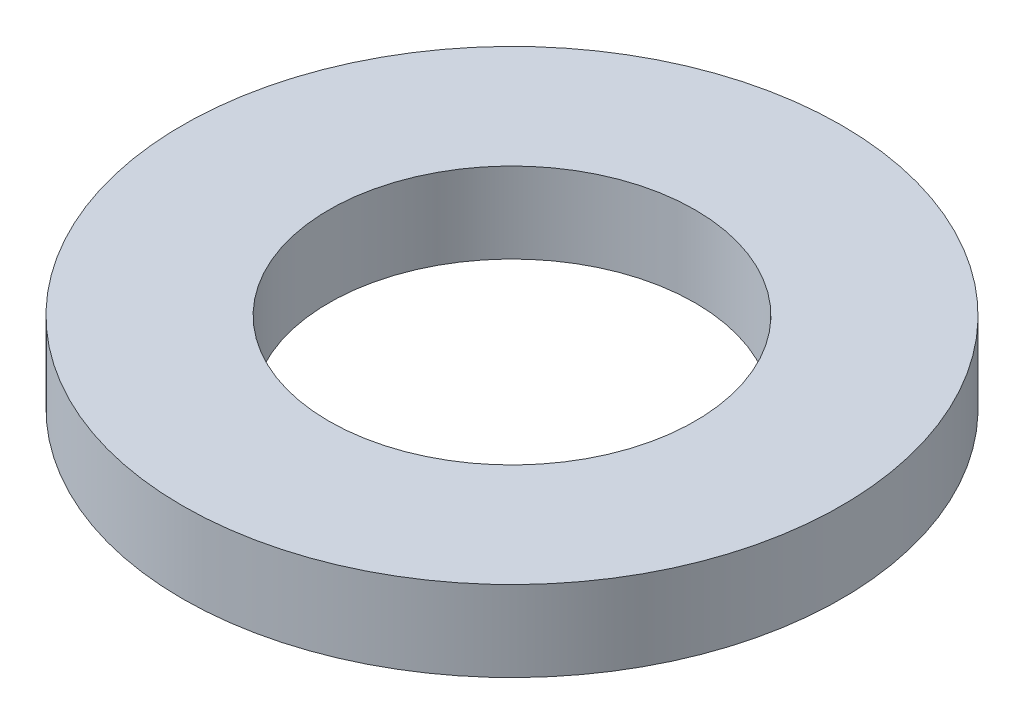
ISO-10303-21;
HEADER;
FILE_DESCRIPTION(('STEP AP214'),'2;1');
FILE_NAME('part.step','',(''),(''),'','','');
FILE_SCHEMA(('AUTOMOTIVE_DESIGN { 1 0 10303 214 1 1 1 1 }'));
ENDSEC;
DATA;
#1=APPLICATION_CONTEXT('core data for automotive mechanical design processes');
#2=APPLICATION_PROTOCOL_DEFINITION('international standard','automotive_design',2000,#1);
#3=PRODUCT_CONTEXT('',#1,'mechanical');
#4=PRODUCT('Part','Part','',(#3));
#5=PRODUCT_RELATED_PRODUCT_CATEGORY('part','',(#4));
#6=PRODUCT_DEFINITION_FORMATION('','',#4);
#7=PRODUCT_DEFINITION_CONTEXT('part definition',#1,'design');
#8=PRODUCT_DEFINITION('design','',#6,#7);
#9=PRODUCT_DEFINITION_SHAPE('','',#8);
#10=(LENGTH_UNIT() NAMED_UNIT(*) SI_UNIT(.MILLI.,.METRE.));
#11=(NAMED_UNIT(*) PLANE_ANGLE_UNIT() SI_UNIT($,.RADIAN.));
#12=(NAMED_UNIT(*) SI_UNIT($,.STERADIAN.) SOLID_ANGLE_UNIT());
#13=UNCERTAINTY_MEASURE_WITH_UNIT(LENGTH_MEASURE(1.E-05),#10,'distance_accuracy_value','');
#14=(GEOMETRIC_REPRESENTATION_CONTEXT(3) GLOBAL_UNCERTAINTY_ASSIGNED_CONTEXT((#13)) GLOBAL_UNIT_ASSIGNED_CONTEXT((#10,
#11,#12)) REPRESENTATION_CONTEXT('',''));
#15=CARTESIAN_POINT('',(0.,0.,0.));
#16=DIRECTION('',(0.,0.,1.));
#17=DIRECTION('',(1.,0.,0.));
#18=AXIS2_PLACEMENT_3D('',#15,#16,#17);
#19=CARTESIAN_POINT('',(0.,11.,0.));
#20=DIRECTION('',(0.,-1.,0.));
#21=DIRECTION('',(0.,0.,-1.));
#22=AXIS2_PLACEMENT_3D('',#19,#20,#21);
#23=CYLINDRICAL_SURFACE('',#22,45.);
#24=CARTESIAN_POINT('',(0.,11.,0.));
#25=DIRECTION('',(0.,1.,0.));
#26=DIRECTION('',(0.,0.,1.));
#27=AXIS2_PLACEMENT_3D('',#24,#25,#26);
#28=CIRCLE('',#27,45.);
#29=CARTESIAN_POINT('',(0.,11.,45.));
#30=VERTEX_POINT('',#29);
#31=EDGE_CURVE('E10',#30,#30,#28,.T.);
#32=ORIENTED_EDGE('',*,*,#31,.F.);
#33=EDGE_LOOP('',(#32));
#34=FACE_BOUND('',#33,.T.);
#35=CARTESIAN_POINT('',(0.,0.,0.));
#36=DIRECTION('',(0.,1.,0.));
#37=DIRECTION('',(0.,0.,1.));
#38=AXIS2_PLACEMENT_3D('',#35,#36,#37);
#39=CIRCLE('',#38,45.);
#40=CARTESIAN_POINT('',(0.,0.,45.));
#41=VERTEX_POINT('',#40);
#42=EDGE_CURVE('E37',#41,#41,#39,.T.);
#43=ORIENTED_EDGE('',*,*,#42,.T.);
#44=EDGE_LOOP('',(#43));
#45=FACE_BOUND('',#44,.T.);
#46=ADVANCED_FACE('F40',(#34,#45),#23,.T.);
#47=CARTESIAN_POINT('',(0.,11.,0.));
#48=DIRECTION('',(0.,1.,0.));
#49=DIRECTION('',(0.,0.,1.));
#50=AXIS2_PLACEMENT_3D('',#47,#48,#49);
#51=PLANE('',#50);
#52=CARTESIAN_POINT('',(0.,11.,0.));
#53=DIRECTION('',(0.,1.,0.));
#54=DIRECTION('',(0.,0.,1.));
#55=AXIS2_PLACEMENT_3D('',#52,#53,#54);
#56=CIRCLE('',#55,25.);
#57=CARTESIAN_POINT('',(0.,11.,25.));
#58=VERTEX_POINT('',#57);
#59=EDGE_CURVE('E50',#58,#58,#56,.T.);
#60=ORIENTED_EDGE('',*,*,#59,.F.);
#61=EDGE_LOOP('',(#60));
#62=FACE_BOUND('',#61,.T.);
#63=ORIENTED_EDGE('',*,*,#31,.T.);
#64=EDGE_LOOP('',(#63));
#65=FACE_BOUND('',#64,.T.);
#66=ADVANCED_FACE('F59',(#62,#65),#51,.T.);
#67=CARTESIAN_POINT('',(0.,0.,0.));
#68=DIRECTION('',(0.,1.,0.));
#69=DIRECTION('',(0.,0.,1.));
#70=AXIS2_PLACEMENT_3D('',#67,#68,#69);
#71=PLANE('',#70);
#72=CARTESIAN_POINT('',(0.,0.,0.));
#73=DIRECTION('',(0.,1.,0.));
#74=DIRECTION('',(0.,0.,1.));
#75=AXIS2_PLACEMENT_3D('',#72,#73,#74);
#76=CIRCLE('',#75,25.);
#77=CARTESIAN_POINT('',(0.,0.,25.));
#78=VERTEX_POINT('',#77);
#79=EDGE_CURVE('E47',#78,#78,#76,.T.);
#80=ORIENTED_EDGE('',*,*,#79,.T.);
#81=EDGE_LOOP('',(#80));
#82=FACE_BOUND('',#81,.T.);
#83=ORIENTED_EDGE('',*,*,#42,.F.);
#84=EDGE_LOOP('',(#83));
#85=FACE_BOUND('',#84,.T.);
#86=ADVANCED_FACE('F58',(#82,#85),#71,.F.);
#87=CARTESIAN_POINT('',(0.,11.,0.));
#88=DIRECTION('',(0.,-1.,0.));
#89=DIRECTION('',(0.,0.,-1.));
#90=AXIS2_PLACEMENT_3D('',#87,#88,#89);
#91=CYLINDRICAL_SURFACE('',#90,25.);
#92=ORIENTED_EDGE('',*,*,#59,.T.);
#93=EDGE_LOOP('',(#92));
#94=FACE_BOUND('',#93,.T.);
#95=ORIENTED_EDGE('',*,*,#79,.F.);
#96=EDGE_LOOP('',(#95));
#97=FACE_BOUND('',#96,.T.);
#98=ADVANCED_FACE('F54',(#94,#97),#91,.F.);
#99=CLOSED_SHELL('',(#46,#66,#86,#98));
#100=MANIFOLD_SOLID_BREP('B2',#99);
#101=ADVANCED_BREP_SHAPE_REPRESENTATION('',(#18,#100),#14);
#102=SHAPE_DEFINITION_REPRESENTATION(#9,#101);
ENDSEC;
END-ISO-10303-21;
